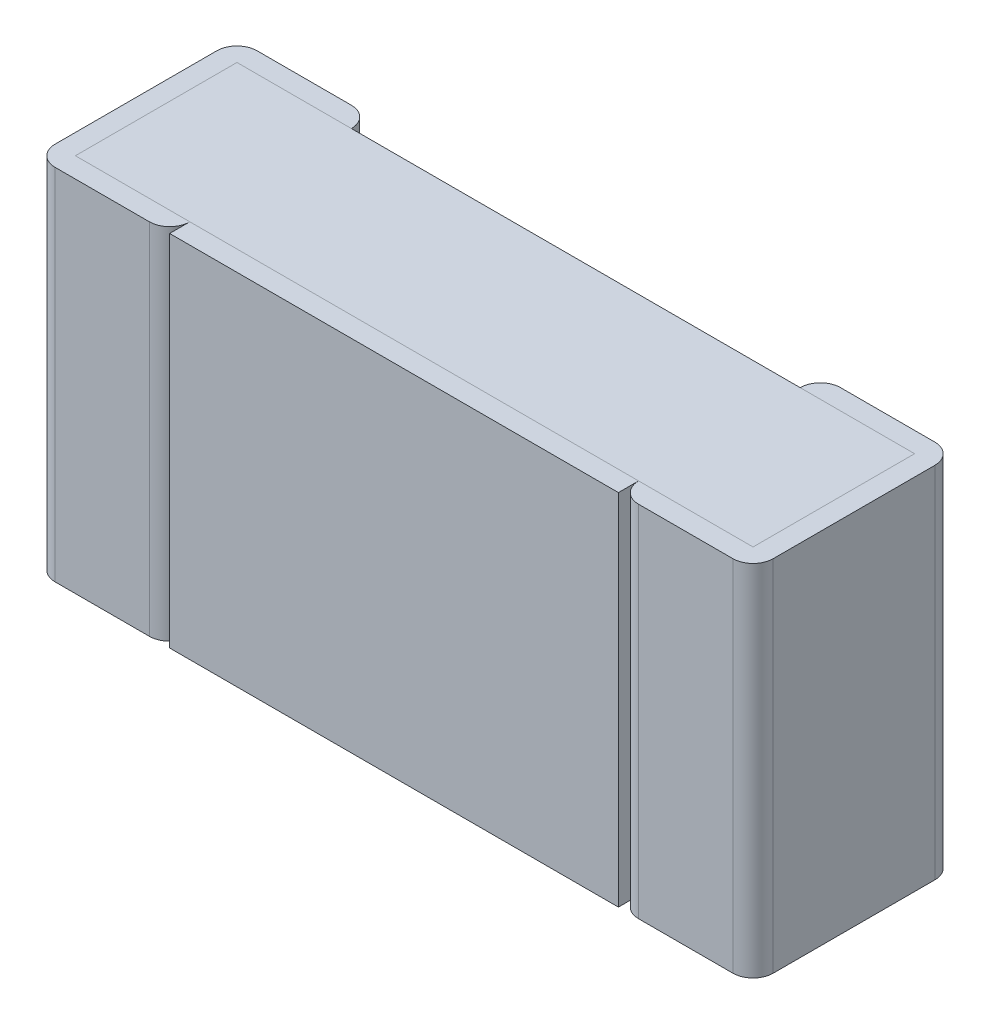
ISO-10303-21;
HEADER;
FILE_DESCRIPTION(('STEP AP214'),'2;1');
FILE_NAME('part.step','',(''),(''),'','','');
FILE_SCHEMA(('AUTOMOTIVE_DESIGN { 1 0 10303 214 1 1 1 1 }'));
ENDSEC;
DATA;
#1=APPLICATION_CONTEXT('core data for automotive mechanical design processes');
#2=APPLICATION_PROTOCOL_DEFINITION('international standard','automotive_design',2000,#1);
#3=PRODUCT_CONTEXT('',#1,'mechanical');
#4=PRODUCT('Part','Part','',(#3));
#5=PRODUCT_RELATED_PRODUCT_CATEGORY('part','',(#4));
#6=PRODUCT_DEFINITION_FORMATION('','',#4);
#7=PRODUCT_DEFINITION_CONTEXT('part definition',#1,'design');
#8=PRODUCT_DEFINITION('design','',#6,#7);
#9=PRODUCT_DEFINITION_SHAPE('','',#8);
#10=(LENGTH_UNIT() NAMED_UNIT(*) SI_UNIT(.MILLI.,.METRE.));
#11=(NAMED_UNIT(*) PLANE_ANGLE_UNIT() SI_UNIT($,.RADIAN.));
#12=(NAMED_UNIT(*) SI_UNIT($,.STERADIAN.) SOLID_ANGLE_UNIT());
#13=UNCERTAINTY_MEASURE_WITH_UNIT(LENGTH_MEASURE(1.E-05),#10,'distance_accuracy_value','');
#14=(GEOMETRIC_REPRESENTATION_CONTEXT(3) GLOBAL_UNCERTAINTY_ASSIGNED_CONTEXT((#13)) GLOBAL_UNIT_ASSIGNED_CONTEXT((#10,
#11,#12)) REPRESENTATION_CONTEXT('',''));
#15=CARTESIAN_POINT('',(0.,0.,0.));
#16=DIRECTION('',(0.,0.,1.));
#17=DIRECTION('',(1.,0.,0.));
#18=AXIS2_PLACEMENT_3D('',#15,#16,#17);
#19=CARTESIAN_POINT('',(181.718744279938,115.36204329235,112.661582908599));
#20=DIRECTION('',(0.,0.,1.));
#21=DIRECTION('',(1.,0.,0.));
#22=AXIS2_PLACEMENT_3D('',#19,#20,#21);
#23=PLANE('',#22);
#24=DIRECTION('',(0.,1.,0.));
#25=VECTOR('',#24,1.);
#26=CARTESIAN_POINT('',(181.718744279938,115.36204329235,112.661582908599));
#27=LINE('',#26,#25);
#28=CARTESIAN_POINT('',(181.718744279938,115.36204329235,112.661582908599));
#29=VERTEX_POINT('',#28);
#30=CARTESIAN_POINT('',(181.718744279938,116.16204329235,112.661582908599));
#31=VERTEX_POINT('',#30);
#32=EDGE_CURVE('E67',#29,#31,#27,.T.);
#33=ORIENTED_EDGE('',*,*,#32,.F.);
#34=DIRECTION('',(1.,0.,0.));
#35=VECTOR('',#34,1.);
#36=CARTESIAN_POINT('',(181.718744279938,115.36204329235,112.661582908599));
#37=LINE('',#36,#35);
#38=CARTESIAN_POINT('',(182.718744279938,115.36204329235,112.661582908599));
#39=VERTEX_POINT('',#38);
#40=EDGE_CURVE('E11',#29,#39,#37,.T.);
#41=ORIENTED_EDGE('',*,*,#40,.T.);
#42=DIRECTION('',(0.,1.,0.));
#43=VECTOR('',#42,1.);
#44=CARTESIAN_POINT('',(182.718744279938,115.36204329235,112.661582908599));
#45=LINE('',#44,#43);
#46=CARTESIAN_POINT('',(182.718744279938,116.16204329235,112.661582908599));
#47=VERTEX_POINT('',#46);
#48=EDGE_CURVE('E55',#39,#47,#45,.T.);
#49=ORIENTED_EDGE('',*,*,#48,.T.);
#50=DIRECTION('',(1.,0.,0.));
#51=VECTOR('',#50,1.);
#52=CARTESIAN_POINT('',(181.718744279938,116.16204329235,112.661582908599));
#53=LINE('',#52,#51);
#54=EDGE_CURVE('E317',#31,#47,#53,.T.);
#55=ORIENTED_EDGE('',*,*,#54,.F.);
#56=EDGE_LOOP('',(#33,#41,#49,#55));
#57=FACE_BOUND('',#56,.T.);
#58=ADVANCED_FACE('F44',(#57),#23,.T.);
#59=CARTESIAN_POINT('',(182.718744279938,115.36204329235,112.616582908599));
#60=DIRECTION('',(1.,0.,0.));
#61=DIRECTION('',(0.,1.,0.));
#62=AXIS2_PLACEMENT_3D('',#59,#60,#61);
#63=PLANE('',#62);
#64=DIRECTION('',(0.,0.,1.));
#65=VECTOR('',#64,1.);
#66=CARTESIAN_POINT('',(182.718744279938,115.36204329235,112.616582908599));
#67=LINE('',#66,#65);
#68=CARTESIAN_POINT('',(182.718744279938,115.36204329235,112.616582908599));
#69=VERTEX_POINT('',#68);
#70=EDGE_CURVE('E341',#69,#39,#67,.T.);
#71=ORIENTED_EDGE('',*,*,#70,.F.);
#72=DIRECTION('',(0.,1.,0.));
#73=VECTOR('',#72,1.);
#74=CARTESIAN_POINT('',(182.718744279938,115.36204329235,112.616582908599));
#75=LINE('',#74,#73);
#76=CARTESIAN_POINT('',(182.718744279938,116.16204329235,112.616582908599));
#77=VERTEX_POINT('',#76);
#78=EDGE_CURVE('E349',#69,#77,#75,.T.);
#79=ORIENTED_EDGE('',*,*,#78,.T.);
#80=DIRECTION('',(0.,0.,1.));
#81=VECTOR('',#80,1.);
#82=CARTESIAN_POINT('',(182.718744279938,116.16204329235,112.616582908599));
#83=LINE('',#82,#81);
#84=EDGE_CURVE('E334',#77,#47,#83,.T.);
#85=ORIENTED_EDGE('',*,*,#84,.T.);
#86=ORIENTED_EDGE('',*,*,#48,.F.);
#87=EDGE_LOOP('',(#71,#79,#85,#86));
#88=FACE_BOUND('',#87,.T.);
#89=ADVANCED_FACE('F417',(#88),#63,.T.);
#90=CARTESIAN_POINT('',(182.763744279938,115.36204329235,112.616582908599));
#91=DIRECTION('',(0.,1.,0.));
#92=DIRECTION('',(-1.,0.,0.));
#93=AXIS2_PLACEMENT_3D('',#90,#91,#92);
#94=CYLINDRICAL_SURFACE('',#93,0.0449999999999895);
#95=CARTESIAN_POINT('',(182.763744279938,115.36204329235,112.616582908599));
#96=DIRECTION('',(0.,1.,0.));
#97=DIRECTION('',(0.,0.,1.));
#98=AXIS2_PLACEMENT_3D('',#95,#96,#97);
#99=CIRCLE('',#98,0.0450000000000034);
#100=CARTESIAN_POINT('',(182.763744279938,115.36204329235,112.661582908599));
#101=VERTEX_POINT('',#100);
#102=EDGE_CURVE('E330',#69,#101,#99,.T.);
#103=ORIENTED_EDGE('',*,*,#102,.T.);
#104=DIRECTION('',(0.,1.,0.));
#105=VECTOR('',#104,1.);
#106=CARTESIAN_POINT('',(182.763744279938,115.36204329235,112.661582908599));
#107=LINE('',#106,#105);
#108=CARTESIAN_POINT('',(182.763744279938,116.16204329235,112.661582908599));
#109=VERTEX_POINT('',#108);
#110=EDGE_CURVE('E335',#101,#109,#107,.T.);
#111=ORIENTED_EDGE('',*,*,#110,.T.);
#112=CARTESIAN_POINT('',(182.763744279938,116.16204329235,112.616582908599));
#113=DIRECTION('',(0.,1.,0.));
#114=DIRECTION('',(0.,0.,1.));
#115=AXIS2_PLACEMENT_3D('',#112,#113,#114);
#116=CIRCLE('',#115,0.0450000000000034);
#117=EDGE_CURVE('E260',#77,#109,#116,.T.);
#118=ORIENTED_EDGE('',*,*,#117,.F.);
#119=ORIENTED_EDGE('',*,*,#78,.F.);
#120=EDGE_LOOP('',(#103,#111,#118,#119));
#121=FACE_BOUND('',#120,.T.);
#122=ADVANCED_FACE('F564',(#121),#94,.T.);
#123=CARTESIAN_POINT('',(182.718744279938,115.36204329235,112.661582908599));
#124=DIRECTION('',(0.,0.,1.));
#125=DIRECTION('',(1.,0.,0.));
#126=AXIS2_PLACEMENT_3D('',#123,#124,#125);
#127=PLANE('',#126);
#128=DIRECTION('',(1.,0.,0.));
#129=VECTOR('',#128,1.);
#130=CARTESIAN_POINT('',(182.718744279938,116.16204329235,112.661582908599));
#131=LINE('',#130,#129);
#132=CARTESIAN_POINT('',(182.973744279938,116.16204329235,112.661582908599));
#133=VERTEX_POINT('',#132);
#134=EDGE_CURVE('E409',#109,#133,#131,.T.);
#135=ORIENTED_EDGE('',*,*,#134,.F.);
#136=ORIENTED_EDGE('',*,*,#110,.F.);
#137=DIRECTION('',(1.,0.,0.));
#138=VECTOR('',#137,1.);
#139=CARTESIAN_POINT('',(182.718744279938,115.36204329235,112.661582908599));
#140=LINE('',#139,#138);
#141=CARTESIAN_POINT('',(182.973744279938,115.36204329235,112.661582908599));
#142=VERTEX_POINT('',#141);
#143=EDGE_CURVE('E401',#101,#142,#140,.T.);
#144=ORIENTED_EDGE('',*,*,#143,.T.);
#145=DIRECTION('',(0.,1.,0.));
#146=VECTOR('',#145,1.);
#147=CARTESIAN_POINT('',(182.973744279938,115.36204329235,112.661582908599));
#148=LINE('',#147,#146);
#149=EDGE_CURVE('E344',#142,#133,#148,.T.);
#150=ORIENTED_EDGE('',*,*,#149,.T.);
#151=EDGE_LOOP('',(#135,#136,#144,#150));
#152=FACE_BOUND('',#151,.T.);
#153=ADVANCED_FACE('F592',(#152),#127,.T.);
#154=CARTESIAN_POINT('',(182.973744279938,115.36204329235,112.616582908599));
#155=DIRECTION('',(0.,1.,0.));
#156=DIRECTION('',(1.,0.,0.));
#157=AXIS2_PLACEMENT_3D('',#154,#155,#156);
#158=CYLINDRICAL_SURFACE('',#157,0.0449999999999895);
#159=DIRECTION('',(0.,1.,0.));
#160=VECTOR('',#159,1.);
#161=CARTESIAN_POINT('',(183.018744279938,115.36204329235,112.616582908599));
#162=LINE('',#161,#160);
#163=CARTESIAN_POINT('',(183.018744279938,115.36204329235,112.616582908599));
#164=VERTEX_POINT('',#163);
#165=CARTESIAN_POINT('',(183.018744279938,116.16204329235,112.616582908599));
#166=VERTEX_POINT('',#165);
#167=EDGE_CURVE('E214',#164,#166,#162,.T.);
#168=ORIENTED_EDGE('',*,*,#167,.T.);
#169=CARTESIAN_POINT('',(182.973744279938,116.16204329235,112.616582908599));
#170=DIRECTION('',(0.,-1.,0.));
#171=DIRECTION('',(0.,0.,1.));
#172=AXIS2_PLACEMENT_3D('',#169,#170,#171);
#173=CIRCLE('',#172,0.0450000000000034);
#174=EDGE_CURVE('E231',#166,#133,#173,.T.);
#175=ORIENTED_EDGE('',*,*,#174,.T.);
#176=ORIENTED_EDGE('',*,*,#149,.F.);
#177=CARTESIAN_POINT('',(182.973744279938,115.36204329235,112.616582908599));
#178=DIRECTION('',(0.,-1.,0.));
#179=DIRECTION('',(0.,0.,1.));
#180=AXIS2_PLACEMENT_3D('',#177,#178,#179);
#181=CIRCLE('',#180,0.0450000000000034);
#182=EDGE_CURVE('E220',#164,#142,#181,.T.);
#183=ORIENTED_EDGE('',*,*,#182,.F.);
#184=EDGE_LOOP('',(#168,#175,#176,#183));
#185=FACE_BOUND('',#184,.T.);
#186=ADVANCED_FACE('F596',(#185),#158,.T.);
#187=CARTESIAN_POINT('',(183.018744279938,115.36204329235,112.211582908599));
#188=DIRECTION('',(1.,0.,0.));
#189=DIRECTION('',(0.,1.,0.));
#190=AXIS2_PLACEMENT_3D('',#187,#188,#189);
#191=PLANE('',#190);
#192=DIRECTION('',(0.,0.,1.));
#193=VECTOR('',#192,1.);
#194=CARTESIAN_POINT('',(183.018744279938,115.36204329235,112.211582908599));
#195=LINE('',#194,#193);
#196=CARTESIAN_POINT('',(183.018744279938,115.36204329235,112.256582908599));
#197=VERTEX_POINT('',#196);
#198=EDGE_CURVE('E207',#197,#164,#195,.T.);
#199=ORIENTED_EDGE('',*,*,#198,.F.);
#200=DIRECTION('',(0.,1.,0.));
#201=VECTOR('',#200,1.);
#202=CARTESIAN_POINT('',(183.018744279938,115.36204329235,112.256582908599));
#203=LINE('',#202,#201);
#204=CARTESIAN_POINT('',(183.018744279938,116.16204329235,112.256582908599));
#205=VERTEX_POINT('',#204);
#206=EDGE_CURVE('E211',#197,#205,#203,.T.);
#207=ORIENTED_EDGE('',*,*,#206,.T.);
#208=DIRECTION('',(0.,0.,1.));
#209=VECTOR('',#208,1.);
#210=CARTESIAN_POINT('',(183.018744279938,116.16204329235,112.211582908599));
#211=LINE('',#210,#209);
#212=EDGE_CURVE('E232',#205,#166,#211,.T.);
#213=ORIENTED_EDGE('',*,*,#212,.T.);
#214=ORIENTED_EDGE('',*,*,#167,.F.);
#215=EDGE_LOOP('',(#199,#207,#213,#214));
#216=FACE_BOUND('',#215,.T.);
#217=ADVANCED_FACE('F209',(#216),#191,.T.);
#218=CARTESIAN_POINT('',(182.973744279938,115.36204329235,112.256582908599));
#219=DIRECTION('',(0.,1.,0.));
#220=DIRECTION('',(1.,0.,0.));
#221=AXIS2_PLACEMENT_3D('',#218,#219,#220);
#222=CYLINDRICAL_SURFACE('',#221,0.0449999999999895);
#223=CARTESIAN_POINT('',(182.973744279938,115.36204329235,112.256582908599));
#224=DIRECTION('',(0.,1.,0.));
#225=DIRECTION('',(0.,0.,1.));
#226=AXIS2_PLACEMENT_3D('',#223,#224,#225);
#227=CIRCLE('',#226,0.0450000000000034);
#228=CARTESIAN_POINT('',(182.973744279938,115.36204329235,112.211582908599));
#229=VERTEX_POINT('',#228);
#230=EDGE_CURVE('E226',#197,#229,#227,.T.);
#231=ORIENTED_EDGE('',*,*,#230,.T.);
#232=DIRECTION('',(0.,1.,0.));
#233=VECTOR('',#232,1.);
#234=CARTESIAN_POINT('',(182.973744279938,115.36204329235,112.211582908599));
#235=LINE('',#234,#233);
#236=CARTESIAN_POINT('',(182.973744279938,116.16204329235,112.211582908599));
#237=VERTEX_POINT('',#236);
#238=EDGE_CURVE('E238',#229,#237,#235,.T.);
#239=ORIENTED_EDGE('',*,*,#238,.T.);
#240=CARTESIAN_POINT('',(182.973744279938,116.16204329235,112.256582908599));
#241=DIRECTION('',(0.,1.,0.));
#242=DIRECTION('',(0.,0.,1.));
#243=AXIS2_PLACEMENT_3D('',#240,#241,#242);
#244=CIRCLE('',#243,0.0450000000000034);
#245=EDGE_CURVE('E229',#205,#237,#244,.T.);
#246=ORIENTED_EDGE('',*,*,#245,.F.);
#247=ORIENTED_EDGE('',*,*,#206,.F.);
#248=EDGE_LOOP('',(#231,#239,#246,#247));
#249=FACE_BOUND('',#248,.T.);
#250=ADVANCED_FACE('F224',(#249),#222,.T.);
#251=CARTESIAN_POINT('',(182.718744279938,115.36204329235,112.211582908599));
#252=DIRECTION('',(0.,0.,1.));
#253=DIRECTION('',(1.,0.,0.));
#254=AXIS2_PLACEMENT_3D('',#251,#252,#253);
#255=PLANE('',#254);
#256=ORIENTED_EDGE('',*,*,#238,.F.);
#257=DIRECTION('',(1.,0.,0.));
#258=VECTOR('',#257,1.);
#259=CARTESIAN_POINT('',(182.718744279938,115.36204329235,112.211582908599));
#260=LINE('',#259,#258);
#261=CARTESIAN_POINT('',(182.763744279938,115.36204329235,112.211582908599));
#262=VERTEX_POINT('',#261);
#263=EDGE_CURVE('E236',#262,#229,#260,.T.);
#264=ORIENTED_EDGE('',*,*,#263,.F.);
#265=DIRECTION('',(0.,1.,0.));
#266=VECTOR('',#265,1.);
#267=CARTESIAN_POINT('',(182.763744279938,115.36204329235,112.211582908599));
#268=LINE('',#267,#266);
#269=CARTESIAN_POINT('',(182.763744279938,116.16204329235,112.211582908599));
#270=VERTEX_POINT('',#269);
#271=EDGE_CURVE('E246',#262,#270,#268,.T.);
#272=ORIENTED_EDGE('',*,*,#271,.T.);
#273=DIRECTION('',(1.,0.,0.));
#274=VECTOR('',#273,1.);
#275=CARTESIAN_POINT('',(182.718744279938,116.16204329235,112.211582908599));
#276=LINE('',#275,#274);
#277=EDGE_CURVE('E286',#270,#237,#276,.T.);
#278=ORIENTED_EDGE('',*,*,#277,.T.);
#279=EDGE_LOOP('',(#256,#264,#272,#278));
#280=FACE_BOUND('',#279,.T.);
#281=ADVANCED_FACE('F473',(#280),#255,.F.);
#282=CARTESIAN_POINT('',(182.763744279938,115.36204329235,112.256582908599));
#283=DIRECTION('',(0.,1.,0.));
#284=DIRECTION('',(-1.,0.,0.));
#285=AXIS2_PLACEMENT_3D('',#282,#283,#284);
#286=CYLINDRICAL_SURFACE('',#285,0.0449999999999895);
#287=DIRECTION('',(0.,1.,0.));
#288=VECTOR('',#287,1.);
#289=CARTESIAN_POINT('',(182.718744279938,115.36204329235,112.256582908599));
#290=LINE('',#289,#288);
#291=CARTESIAN_POINT('',(182.718744279938,115.36204329235,112.256582908599));
#292=VERTEX_POINT('',#291);
#293=CARTESIAN_POINT('',(182.718744279938,116.16204329235,112.256582908599));
#294=VERTEX_POINT('',#293);
#295=EDGE_CURVE('E290',#292,#294,#290,.T.);
#296=ORIENTED_EDGE('',*,*,#295,.T.);
#297=CARTESIAN_POINT('',(182.763744279938,116.16204329235,112.256582908599));
#298=DIRECTION('',(0.,-1.,0.));
#299=DIRECTION('',(0.,0.,1.));
#300=AXIS2_PLACEMENT_3D('',#297,#298,#299);
#301=CIRCLE('',#300,0.0450000000000034);
#302=EDGE_CURVE('E358',#294,#270,#301,.T.);
#303=ORIENTED_EDGE('',*,*,#302,.T.);
#304=ORIENTED_EDGE('',*,*,#271,.F.);
#305=CARTESIAN_POINT('',(182.763744279938,115.36204329235,112.256582908599));
#306=DIRECTION('',(0.,-1.,0.));
#307=DIRECTION('',(0.,0.,1.));
#308=AXIS2_PLACEMENT_3D('',#305,#306,#307);
#309=CIRCLE('',#308,0.0450000000000034);
#310=EDGE_CURVE('E302',#292,#262,#309,.T.);
#311=ORIENTED_EDGE('',*,*,#310,.F.);
#312=EDGE_LOOP('',(#296,#303,#304,#311));
#313=FACE_BOUND('',#312,.T.);
#314=ADVANCED_FACE('F477',(#313),#286,.T.);
#315=CARTESIAN_POINT('',(181.718744279938,116.16204329235,112.616582908599));
#316=DIRECTION('',(0.,1.,0.));
#317=DIRECTION('',(1.,0.,0.));
#318=AXIS2_PLACEMENT_3D('',#315,#316,#317);
#319=PLANE('',#318);
#320=DIRECTION('',(1.,0.,0.));
#321=VECTOR('',#320,1.);
#322=CARTESIAN_POINT('',(181.718744279938,116.16204329235,112.616582908599));
#323=LINE('',#322,#321);
#324=CARTESIAN_POINT('',(181.718744279938,116.16204329235,112.616582908599));
#325=VERTEX_POINT('',#324);
#326=EDGE_CURVE('E291',#325,#77,#323,.T.);
#327=ORIENTED_EDGE('',*,*,#326,.F.);
#328=DIRECTION('',(0.,0.,1.));
#329=VECTOR('',#328,1.);
#330=CARTESIAN_POINT('',(181.718744279938,116.16204329235,112.616582908599));
#331=LINE('',#330,#329);
#332=EDGE_CURVE('E321',#325,#31,#331,.T.);
#333=ORIENTED_EDGE('',*,*,#332,.T.);
#334=ORIENTED_EDGE('',*,*,#54,.T.);
#335=ORIENTED_EDGE('',*,*,#84,.F.);
#336=EDGE_LOOP('',(#327,#333,#334,#335));
#337=FACE_BOUND('',#336,.T.);
#338=ADVANCED_FACE('F549',(#337),#319,.T.);
#339=CARTESIAN_POINT('',(182.718744279938,116.16204329235,112.211582908599));
#340=DIRECTION('',(0.,1.,0.));
#341=DIRECTION('',(1.,0.,0.));
#342=AXIS2_PLACEMENT_3D('',#339,#340,#341);
#343=PLANE('',#342);
#344=ORIENTED_EDGE('',*,*,#277,.F.);
#345=ORIENTED_EDGE('',*,*,#302,.F.);
#346=DIRECTION('',(1.,0.,0.));
#347=VECTOR('',#346,1.);
#348=CARTESIAN_POINT('',(181.463744279938,116.16204329235,112.256582908599));
#349=LINE('',#348,#347);
#350=CARTESIAN_POINT('',(182.973744279938,116.16204329235,112.256582908599));
#351=VERTEX_POINT('',#350);
#352=EDGE_CURVE('E259',#294,#351,#349,.T.);
#353=ORIENTED_EDGE('',*,*,#352,.T.);
#354=DIRECTION('',(0.,0.,1.));
#355=VECTOR('',#354,1.);
#356=CARTESIAN_POINT('',(182.973744279938,116.16204329235,112.256582908599));
#357=LINE('',#356,#355);
#358=CARTESIAN_POINT('',(182.973744279938,116.16204329235,112.616582908599));
#359=VERTEX_POINT('',#358);
#360=EDGE_CURVE('E256',#351,#359,#357,.T.);
#361=ORIENTED_EDGE('',*,*,#360,.T.);
#362=DIRECTION('',(1.,0.,0.));
#363=VECTOR('',#362,1.);
#364=CARTESIAN_POINT('',(181.463744279938,116.16204329235,112.616582908599));
#365=LINE('',#364,#363);
#366=EDGE_CURVE('E295',#77,#359,#365,.T.);
#367=ORIENTED_EDGE('',*,*,#366,.F.);
#368=ORIENTED_EDGE('',*,*,#117,.T.);
#369=ORIENTED_EDGE('',*,*,#134,.T.);
#370=ORIENTED_EDGE('',*,*,#174,.F.);
#371=ORIENTED_EDGE('',*,*,#212,.F.);
#372=ORIENTED_EDGE('',*,*,#245,.T.);
#373=EDGE_LOOP('',(#344,#345,#353,#361,#367,#368,#369,#370,#371,#372));
#374=FACE_BOUND('',#373,.T.);
#375=ADVANCED_FACE('F481',(#374),#343,.T.);
#376=CARTESIAN_POINT('',(181.718744279938,115.36204329235,112.616582908599));
#377=DIRECTION('',(1.,0.,0.));
#378=DIRECTION('',(0.,1.,0.));
#379=AXIS2_PLACEMENT_3D('',#376,#377,#378);
#380=PLANE('',#379);
#381=ORIENTED_EDGE('',*,*,#32,.T.);
#382=ORIENTED_EDGE('',*,*,#332,.F.);
#383=DIRECTION('',(0.,1.,0.));
#384=VECTOR('',#383,1.);
#385=CARTESIAN_POINT('',(181.718744279938,115.36204329235,112.616582908599));
#386=LINE('',#385,#384);
#387=CARTESIAN_POINT('',(181.718744279938,115.36204329235,112.616582908599));
#388=VERTEX_POINT('',#387);
#389=EDGE_CURVE('E325',#388,#325,#386,.T.);
#390=ORIENTED_EDGE('',*,*,#389,.F.);
#391=DIRECTION('',(0.,0.,1.));
#392=VECTOR('',#391,1.);
#393=CARTESIAN_POINT('',(181.718744279938,115.36204329235,112.616582908599));
#394=LINE('',#393,#392);
#395=EDGE_CURVE('E313',#388,#29,#394,.T.);
#396=ORIENTED_EDGE('',*,*,#395,.T.);
#397=EDGE_LOOP('',(#381,#382,#390,#396));
#398=FACE_BOUND('',#397,.T.);
#399=ADVANCED_FACE('F543',(#398),#380,.F.);
#400=CARTESIAN_POINT('',(181.718744279938,115.36204329235,112.616582908599));
#401=DIRECTION('',(0.,1.,0.));
#402=DIRECTION('',(1.,0.,0.));
#403=AXIS2_PLACEMENT_3D('',#400,#401,#402);
#404=PLANE('',#403);
#405=ORIENTED_EDGE('',*,*,#70,.T.);
#406=ORIENTED_EDGE('',*,*,#40,.F.);
#407=ORIENTED_EDGE('',*,*,#395,.F.);
#408=DIRECTION('',(1.,0.,0.));
#409=VECTOR('',#408,1.);
#410=CARTESIAN_POINT('',(181.718744279938,115.36204329235,112.616582908599));
#411=LINE('',#410,#409);
#412=EDGE_CURVE('E219',#388,#69,#411,.T.);
#413=ORIENTED_EDGE('',*,*,#412,.T.);
#414=EDGE_LOOP('',(#405,#406,#407,#413));
#415=FACE_BOUND('',#414,.T.);
#416=ADVANCED_FACE('F587',(#415),#404,.F.);
#417=CARTESIAN_POINT('',(182.718744279938,115.36204329235,112.211582908599));
#418=DIRECTION('',(0.,1.,0.));
#419=DIRECTION('',(1.,0.,0.));
#420=AXIS2_PLACEMENT_3D('',#417,#418,#419);
#421=PLANE('',#420);
#422=ORIENTED_EDGE('',*,*,#230,.F.);
#423=ORIENTED_EDGE('',*,*,#198,.T.);
#424=ORIENTED_EDGE('',*,*,#182,.T.);
#425=ORIENTED_EDGE('',*,*,#143,.F.);
#426=ORIENTED_EDGE('',*,*,#102,.F.);
#427=DIRECTION('',(1.,0.,0.));
#428=VECTOR('',#427,1.);
#429=CARTESIAN_POINT('',(181.463744279938,115.36204329235,112.616582908599));
#430=LINE('',#429,#428);
#431=CARTESIAN_POINT('',(182.973744279938,115.36204329235,112.616582908599));
#432=VERTEX_POINT('',#431);
#433=EDGE_CURVE('E305',#69,#432,#430,.T.);
#434=ORIENTED_EDGE('',*,*,#433,.T.);
#435=DIRECTION('',(0.,0.,1.));
#436=VECTOR('',#435,1.);
#437=CARTESIAN_POINT('',(182.973744279938,115.36204329235,112.256582908599));
#438=LINE('',#437,#436);
#439=CARTESIAN_POINT('',(182.973744279938,115.36204329235,112.256582908599));
#440=VERTEX_POINT('',#439);
#441=EDGE_CURVE('E255',#440,#432,#438,.T.);
#442=ORIENTED_EDGE('',*,*,#441,.F.);
#443=DIRECTION('',(1.,0.,0.));
#444=VECTOR('',#443,1.);
#445=CARTESIAN_POINT('',(181.463744279938,115.36204329235,112.256582908599));
#446=LINE('',#445,#444);
#447=EDGE_CURVE('E251',#292,#440,#446,.T.);
#448=ORIENTED_EDGE('',*,*,#447,.F.);
#449=ORIENTED_EDGE('',*,*,#310,.T.);
#450=ORIENTED_EDGE('',*,*,#263,.T.);
#451=EDGE_LOOP('',(#422,#423,#424,#425,#426,#434,#442,#448,#449,#450));
#452=FACE_BOUND('',#451,.T.);
#453=ADVANCED_FACE('F234',(#452),#421,.F.);
#454=CARTESIAN_POINT('',(181.463744279938,115.36204329235,112.256582908599));
#455=DIRECTION('',(0.,0.,1.));
#456=DIRECTION('',(1.,0.,0.));
#457=AXIS2_PLACEMENT_3D('',#454,#455,#456);
#458=PLANE('',#457);
#459=DIRECTION('',(1.,0.,0.));
#460=VECTOR('',#459,1.);
#461=CARTESIAN_POINT('',(181.463744279938,116.16204329235,112.256582908599));
#462=LINE('',#461,#460);
#463=CARTESIAN_POINT('',(181.718744279938,116.16204329235,112.256582908599));
#464=VERTEX_POINT('',#463);
#465=EDGE_CURVE('E338',#464,#294,#462,.T.);
#466=ORIENTED_EDGE('',*,*,#465,.T.);
#467=ORIENTED_EDGE('',*,*,#295,.F.);
#468=DIRECTION('',(1.,0.,0.));
#469=VECTOR('',#468,1.);
#470=CARTESIAN_POINT('',(181.463744279938,115.36204329235,112.256582908599));
#471=LINE('',#470,#469);
#472=CARTESIAN_POINT('',(181.718744279938,115.36204329235,112.256582908599));
#473=VERTEX_POINT('',#472);
#474=EDGE_CURVE('E254',#473,#292,#471,.T.);
#475=ORIENTED_EDGE('',*,*,#474,.F.);
#476=DIRECTION('',(0.,1.,0.));
#477=VECTOR('',#476,1.);
#478=CARTESIAN_POINT('',(181.718744279938,115.36204329235,112.256582908599));
#479=LINE('',#478,#477);
#480=EDGE_CURVE('E359',#473,#464,#479,.T.);
#481=ORIENTED_EDGE('',*,*,#480,.T.);
#482=EDGE_LOOP('',(#466,#467,#475,#481));
#483=FACE_BOUND('',#482,.T.);
#484=ADVANCED_FACE('F527',(#483),#458,.F.);
#485=CARTESIAN_POINT('',(181.463744279938,116.16204329235,112.256582908599));
#486=DIRECTION('',(0.,1.,0.));
#487=DIRECTION('',(1.,0.,0.));
#488=AXIS2_PLACEMENT_3D('',#485,#486,#487);
#489=PLANE('',#488);
#490=DIRECTION('',(1.,0.,0.));
#491=VECTOR('',#490,1.);
#492=CARTESIAN_POINT('',(181.463744279938,116.16204329235,112.256582908599));
#493=LINE('',#492,#491);
#494=CARTESIAN_POINT('',(181.463744279938,116.16204329235,112.256582908599));
#495=VERTEX_POINT('',#494);
#496=EDGE_CURVE('E284',#495,#464,#493,.T.);
#497=ORIENTED_EDGE('',*,*,#496,.F.);
#498=DIRECTION('',(0.,0.,1.));
#499=VECTOR('',#498,1.);
#500=CARTESIAN_POINT('',(181.463744279938,116.16204329235,112.256582908599));
#501=LINE('',#500,#499);
#502=CARTESIAN_POINT('',(181.463744279938,116.16204329235,112.616582908599));
#503=VERTEX_POINT('',#502);
#504=EDGE_CURVE('E362',#495,#503,#501,.T.);
#505=ORIENTED_EDGE('',*,*,#504,.T.);
#506=DIRECTION('',(1.,0.,0.));
#507=VECTOR('',#506,1.);
#508=CARTESIAN_POINT('',(181.463744279938,116.16204329235,112.616582908599));
#509=LINE('',#508,#507);
#510=EDGE_CURVE('E294',#503,#325,#509,.T.);
#511=ORIENTED_EDGE('',*,*,#510,.T.);
#512=ORIENTED_EDGE('',*,*,#326,.T.);
#513=ORIENTED_EDGE('',*,*,#366,.T.);
#514=ORIENTED_EDGE('',*,*,#360,.F.);
#515=ORIENTED_EDGE('',*,*,#352,.F.);
#516=ORIENTED_EDGE('',*,*,#465,.F.);
#517=EDGE_LOOP('',(#497,#505,#511,#512,#513,#514,#515,#516));
#518=FACE_BOUND('',#517,.T.);
#519=ADVANCED_FACE('F532',(#518),#489,.T.);
#520=CARTESIAN_POINT('',(181.673744279938,115.36204329235,112.616582908599));
#521=DIRECTION('',(0.,1.,0.));
#522=DIRECTION('',(1.,0.,0.));
#523=AXIS2_PLACEMENT_3D('',#520,#521,#522);
#524=CYLINDRICAL_SURFACE('',#523,0.0449999999999895);
#525=ORIENTED_EDGE('',*,*,#389,.T.);
#526=CARTESIAN_POINT('',(181.673744279938,116.16204329235,112.616582908599));
#527=DIRECTION('',(0.,-1.,0.));
#528=DIRECTION('',(0.,0.,1.));
#529=AXIS2_PLACEMENT_3D('',#526,#527,#528);
#530=CIRCLE('',#529,0.0450000000000034);
#531=CARTESIAN_POINT('',(181.673744279938,116.16204329235,112.661582908599));
#532=VERTEX_POINT('',#531);
#533=EDGE_CURVE('E265',#325,#532,#530,.T.);
#534=ORIENTED_EDGE('',*,*,#533,.T.);
#535=DIRECTION('',(0.,1.,0.));
#536=VECTOR('',#535,1.);
#537=CARTESIAN_POINT('',(181.673744279938,115.36204329235,112.661582908599));
#538=LINE('',#537,#536);
#539=CARTESIAN_POINT('',(181.673744279938,115.36204329235,112.661582908599));
#540=VERTEX_POINT('',#539);
#541=EDGE_CURVE('E266',#540,#532,#538,.T.);
#542=ORIENTED_EDGE('',*,*,#541,.F.);
#543=CARTESIAN_POINT('',(181.673744279938,115.36204329235,112.616582908599));
#544=DIRECTION('',(0.,-1.,0.));
#545=DIRECTION('',(0.,0.,1.));
#546=AXIS2_PLACEMENT_3D('',#543,#544,#545);
#547=CIRCLE('',#546,0.0450000000000034);
#548=EDGE_CURVE('E279',#388,#540,#547,.T.);
#549=ORIENTED_EDGE('',*,*,#548,.F.);
#550=EDGE_LOOP('',(#525,#534,#542,#549));
#551=FACE_BOUND('',#550,.T.);
#552=ADVANCED_FACE('F548',(#551),#524,.T.);
#553=CARTESIAN_POINT('',(181.418744279938,115.36204329235,112.661582908599));
#554=DIRECTION('',(0.,0.,1.));
#555=DIRECTION('',(1.,0.,0.));
#556=AXIS2_PLACEMENT_3D('',#553,#554,#555);
#557=PLANE('',#556);
#558=DIRECTION('',(1.,0.,0.));
#559=VECTOR('',#558,1.);
#560=CARTESIAN_POINT('',(181.418744279938,116.16204329235,112.661582908599));
#561=LINE('',#560,#559);
#562=CARTESIAN_POINT('',(181.463744279938,116.16204329235,112.661582908599));
#563=VERTEX_POINT('',#562);
#564=EDGE_CURVE('E316',#563,#532,#561,.T.);
#565=ORIENTED_EDGE('',*,*,#564,.F.);
#566=DIRECTION('',(0.,1.,0.));
#567=VECTOR('',#566,1.);
#568=CARTESIAN_POINT('',(181.463744279938,115.36204329235,112.661582908599));
#569=LINE('',#568,#567);
#570=CARTESIAN_POINT('',(181.463744279938,115.36204329235,112.661582908599));
#571=VERTEX_POINT('',#570);
#572=EDGE_CURVE('E383',#571,#563,#569,.T.);
#573=ORIENTED_EDGE('',*,*,#572,.F.);
#574=DIRECTION('',(1.,0.,0.));
#575=VECTOR('',#574,1.);
#576=CARTESIAN_POINT('',(181.418744279938,115.36204329235,112.661582908599));
#577=LINE('',#576,#575);
#578=EDGE_CURVE('E261',#571,#540,#577,.T.);
#579=ORIENTED_EDGE('',*,*,#578,.T.);
#580=ORIENTED_EDGE('',*,*,#541,.T.);
#581=EDGE_LOOP('',(#565,#573,#579,#580));
#582=FACE_BOUND('',#581,.T.);
#583=ADVANCED_FACE('F569',(#582),#557,.T.);
#584=CARTESIAN_POINT('',(181.463744279938,115.36204329235,112.256582908599));
#585=DIRECTION('',(0.,1.,0.));
#586=DIRECTION('',(1.,0.,0.));
#587=AXIS2_PLACEMENT_3D('',#584,#585,#586);
#588=PLANE('',#587);
#589=ORIENTED_EDGE('',*,*,#474,.T.);
#590=ORIENTED_EDGE('',*,*,#447,.T.);
#591=ORIENTED_EDGE('',*,*,#441,.T.);
#592=ORIENTED_EDGE('',*,*,#433,.F.);
#593=ORIENTED_EDGE('',*,*,#412,.F.);
#594=DIRECTION('',(1.,0.,0.));
#595=VECTOR('',#594,1.);
#596=CARTESIAN_POINT('',(181.463744279938,115.36204329235,112.616582908599));
#597=LINE('',#596,#595);
#598=CARTESIAN_POINT('',(181.463744279938,115.36204329235,112.616582908599));
#599=VERTEX_POINT('',#598);
#600=EDGE_CURVE('E460',#599,#388,#597,.T.);
#601=ORIENTED_EDGE('',*,*,#600,.F.);
#602=DIRECTION('',(0.,0.,1.));
#603=VECTOR('',#602,1.);
#604=CARTESIAN_POINT('',(181.463744279938,115.36204329235,112.256582908599));
#605=LINE('',#604,#603);
#606=CARTESIAN_POINT('',(181.463744279938,115.36204329235,112.256582908599));
#607=VERTEX_POINT('',#606);
#608=EDGE_CURVE('E301',#607,#599,#605,.T.);
#609=ORIENTED_EDGE('',*,*,#608,.F.);
#610=DIRECTION('',(1.,0.,0.));
#611=VECTOR('',#610,1.);
#612=CARTESIAN_POINT('',(181.463744279938,115.36204329235,112.256582908599));
#613=LINE('',#612,#611);
#614=EDGE_CURVE('E48',#607,#473,#613,.T.);
#615=ORIENTED_EDGE('',*,*,#614,.T.);
#616=EDGE_LOOP('',(#589,#590,#591,#592,#593,#601,#609,#615));
#617=FACE_BOUND('',#616,.T.);
#618=ADVANCED_FACE('F572',(#617),#588,.F.);
#619=CARTESIAN_POINT('',(181.673744279938,115.36204329235,112.256582908599));
#620=DIRECTION('',(0.,1.,0.));
#621=DIRECTION('',(1.,0.,0.));
#622=AXIS2_PLACEMENT_3D('',#619,#620,#621);
#623=CYLINDRICAL_SURFACE('',#622,0.0449999999999895);
#624=CARTESIAN_POINT('',(181.673744279938,115.36204329235,112.256582908599));
#625=DIRECTION('',(0.,1.,0.));
#626=DIRECTION('',(0.,0.,1.));
#627=AXIS2_PLACEMENT_3D('',#624,#625,#626);
#628=CIRCLE('',#627,0.0450000000000034);
#629=CARTESIAN_POINT('',(181.673744279938,115.36204329235,112.211582908599));
#630=VERTEX_POINT('',#629);
#631=EDGE_CURVE('E271',#473,#630,#628,.T.);
#632=ORIENTED_EDGE('',*,*,#631,.T.);
#633=DIRECTION('',(0.,1.,0.));
#634=VECTOR('',#633,1.);
#635=CARTESIAN_POINT('',(181.673744279938,115.36204329235,112.211582908599));
#636=LINE('',#635,#634);
#637=CARTESIAN_POINT('',(181.673744279938,116.16204329235,112.211582908599));
#638=VERTEX_POINT('',#637);
#639=EDGE_CURVE('E267',#630,#638,#636,.T.);
#640=ORIENTED_EDGE('',*,*,#639,.T.);
#641=CARTESIAN_POINT('',(181.673744279938,116.16204329235,112.256582908599));
#642=DIRECTION('',(0.,1.,0.));
#643=DIRECTION('',(0.,0.,1.));
#644=AXIS2_PLACEMENT_3D('',#641,#642,#643);
#645=CIRCLE('',#644,0.0450000000000034);
#646=EDGE_CURVE('E281',#464,#638,#645,.T.);
#647=ORIENTED_EDGE('',*,*,#646,.F.);
#648=ORIENTED_EDGE('',*,*,#480,.F.);
#649=EDGE_LOOP('',(#632,#640,#647,#648));
#650=FACE_BOUND('',#649,.T.);
#651=ADVANCED_FACE('F535',(#650),#623,.T.);
#652=CARTESIAN_POINT('',(181.418744279938,115.36204329235,112.211582908599));
#653=DIRECTION('',(0.,0.,1.));
#654=DIRECTION('',(1.,0.,0.));
#655=AXIS2_PLACEMENT_3D('',#652,#653,#654);
#656=PLANE('',#655);
#657=ORIENTED_EDGE('',*,*,#639,.F.);
#658=DIRECTION('',(1.,0.,0.));
#659=VECTOR('',#658,1.);
#660=CARTESIAN_POINT('',(181.418744279938,115.36204329235,112.211582908599));
#661=LINE('',#660,#659);
#662=CARTESIAN_POINT('',(181.463744279938,115.36204329235,112.211582908599));
#663=VERTEX_POINT('',#662);
#664=EDGE_CURVE('E280',#663,#630,#661,.T.);
#665=ORIENTED_EDGE('',*,*,#664,.F.);
#666=DIRECTION('',(0.,1.,0.));
#667=VECTOR('',#666,1.);
#668=CARTESIAN_POINT('',(181.463744279938,115.36204329235,112.211582908599));
#669=LINE('',#668,#667);
#670=CARTESIAN_POINT('',(181.463744279938,116.16204329235,112.211582908599));
#671=VERTEX_POINT('',#670);
#672=EDGE_CURVE('E272',#663,#671,#669,.T.);
#673=ORIENTED_EDGE('',*,*,#672,.T.);
#674=DIRECTION('',(1.,0.,0.));
#675=VECTOR('',#674,1.);
#676=CARTESIAN_POINT('',(181.418744279938,116.16204329235,112.211582908599));
#677=LINE('',#676,#675);
#678=EDGE_CURVE('E306',#671,#638,#677,.T.);
#679=ORIENTED_EDGE('',*,*,#678,.T.);
#680=EDGE_LOOP('',(#657,#665,#673,#679));
#681=FACE_BOUND('',#680,.T.);
#682=ADVANCED_FACE('F603',(#681),#656,.F.);
#683=CARTESIAN_POINT('',(181.418744279938,116.16204329235,112.211582908599));
#684=DIRECTION('',(0.,1.,0.));
#685=DIRECTION('',(1.,0.,0.));
#686=AXIS2_PLACEMENT_3D('',#683,#684,#685);
#687=PLANE('',#686);
#688=ORIENTED_EDGE('',*,*,#678,.F.);
#689=CARTESIAN_POINT('',(181.463744279938,116.16204329235,112.256582908599));
#690=DIRECTION('',(0.,-1.,0.));
#691=DIRECTION('',(0.,0.,1.));
#692=AXIS2_PLACEMENT_3D('',#689,#690,#691);
#693=CIRCLE('',#692,0.0450000000000034);
#694=CARTESIAN_POINT('',(181.418744279938,116.16204329235,112.256582908599));
#695=VERTEX_POINT('',#694);
#696=EDGE_CURVE('E296',#695,#671,#693,.T.);
#697=ORIENTED_EDGE('',*,*,#696,.F.);
#698=DIRECTION('',(0.,0.,1.));
#699=VECTOR('',#698,1.);
#700=CARTESIAN_POINT('',(181.418744279938,116.16204329235,112.211582908599));
#701=LINE('',#700,#699);
#702=CARTESIAN_POINT('',(181.418744279938,116.16204329235,112.616582908599));
#703=VERTEX_POINT('',#702);
#704=EDGE_CURVE('E310',#695,#703,#701,.T.);
#705=ORIENTED_EDGE('',*,*,#704,.T.);
#706=CARTESIAN_POINT('',(181.463744279938,116.16204329235,112.616582908599));
#707=DIRECTION('',(0.,1.,0.));
#708=DIRECTION('',(0.,0.,1.));
#709=AXIS2_PLACEMENT_3D('',#706,#707,#708);
#710=CIRCLE('',#709,0.0450000000000034);
#711=EDGE_CURVE('E326',#703,#563,#710,.T.);
#712=ORIENTED_EDGE('',*,*,#711,.T.);
#713=ORIENTED_EDGE('',*,*,#564,.T.);
#714=ORIENTED_EDGE('',*,*,#533,.F.);
#715=ORIENTED_EDGE('',*,*,#510,.F.);
#716=ORIENTED_EDGE('',*,*,#504,.F.);
#717=ORIENTED_EDGE('',*,*,#496,.T.);
#718=ORIENTED_EDGE('',*,*,#646,.T.);
#719=EDGE_LOOP('',(#688,#697,#705,#712,#713,#714,#715,#716,#717,#718));
#720=FACE_BOUND('',#719,.T.);
#721=ADVANCED_FACE('F538',(#720),#687,.T.);
#722=CARTESIAN_POINT('',(181.463744279938,115.36204329235,112.616582908599));
#723=DIRECTION('',(0.,1.,0.));
#724=DIRECTION('',(-1.,0.,0.));
#725=AXIS2_PLACEMENT_3D('',#722,#723,#724);
#726=CYLINDRICAL_SURFACE('',#725,0.0449999999999895);
#727=CARTESIAN_POINT('',(181.463744279938,115.36204329235,112.616582908599));
#728=DIRECTION('',(0.,1.,0.));
#729=DIRECTION('',(0.,0.,1.));
#730=AXIS2_PLACEMENT_3D('',#727,#728,#729);
#731=CIRCLE('',#730,0.0450000000000034);
#732=CARTESIAN_POINT('',(181.418744279938,115.36204329235,112.616582908599));
#733=VERTEX_POINT('',#732);
#734=EDGE_CURVE('E285',#733,#571,#731,.T.);
#735=ORIENTED_EDGE('',*,*,#734,.T.);
#736=ORIENTED_EDGE('',*,*,#572,.T.);
#737=ORIENTED_EDGE('',*,*,#711,.F.);
#738=DIRECTION('',(0.,1.,0.));
#739=VECTOR('',#738,1.);
#740=CARTESIAN_POINT('',(181.418744279938,115.36204329235,112.616582908599));
#741=LINE('',#740,#739);
#742=EDGE_CURVE('E348',#733,#703,#741,.T.);
#743=ORIENTED_EDGE('',*,*,#742,.F.);
#744=EDGE_LOOP('',(#735,#736,#737,#743));
#745=FACE_BOUND('',#744,.T.);
#746=ADVANCED_FACE('F579',(#745),#726,.T.);
#747=CARTESIAN_POINT('',(181.463744279938,115.36204329235,112.256582908599));
#748=DIRECTION('',(0.,1.,0.));
#749=DIRECTION('',(-1.,0.,0.));
#750=AXIS2_PLACEMENT_3D('',#747,#748,#749);
#751=CYLINDRICAL_SURFACE('',#750,0.0449999999999895);
#752=DIRECTION('',(0.,1.,0.));
#753=VECTOR('',#752,1.);
#754=CARTESIAN_POINT('',(181.418744279938,115.36204329235,112.256582908599));
#755=LINE('',#754,#753);
#756=CARTESIAN_POINT('',(181.418744279938,115.36204329235,112.256582908599));
#757=VERTEX_POINT('',#756);
#758=EDGE_CURVE('E300',#757,#695,#755,.T.);
#759=ORIENTED_EDGE('',*,*,#758,.T.);
#760=ORIENTED_EDGE('',*,*,#696,.T.);
#761=ORIENTED_EDGE('',*,*,#672,.F.);
#762=CARTESIAN_POINT('',(181.463744279938,115.36204329235,112.256582908599));
#763=DIRECTION('',(0.,-1.,0.));
#764=DIRECTION('',(0.,0.,1.));
#765=AXIS2_PLACEMENT_3D('',#762,#763,#764);
#766=CIRCLE('',#765,0.0450000000000034);
#767=EDGE_CURVE('E275',#757,#663,#766,.T.);
#768=ORIENTED_EDGE('',*,*,#767,.F.);
#769=EDGE_LOOP('',(#759,#760,#761,#768));
#770=FACE_BOUND('',#769,.T.);
#771=ADVANCED_FACE('F576',(#770),#751,.T.);
#772=CARTESIAN_POINT('',(181.418744279938,115.36204329235,112.211582908599));
#773=DIRECTION('',(0.,1.,0.));
#774=DIRECTION('',(1.,0.,0.));
#775=AXIS2_PLACEMENT_3D('',#772,#773,#774);
#776=PLANE('',#775);
#777=ORIENTED_EDGE('',*,*,#631,.F.);
#778=ORIENTED_EDGE('',*,*,#614,.F.);
#779=ORIENTED_EDGE('',*,*,#608,.T.);
#780=ORIENTED_EDGE('',*,*,#600,.T.);
#781=ORIENTED_EDGE('',*,*,#548,.T.);
#782=ORIENTED_EDGE('',*,*,#578,.F.);
#783=ORIENTED_EDGE('',*,*,#734,.F.);
#784=DIRECTION('',(0.,0.,1.));
#785=VECTOR('',#784,1.);
#786=CARTESIAN_POINT('',(181.418744279938,115.36204329235,112.211582908599));
#787=LINE('',#786,#785);
#788=EDGE_CURVE('E446',#757,#733,#787,.T.);
#789=ORIENTED_EDGE('',*,*,#788,.F.);
#790=ORIENTED_EDGE('',*,*,#767,.T.);
#791=ORIENTED_EDGE('',*,*,#664,.T.);
#792=EDGE_LOOP('',(#777,#778,#779,#780,#781,#782,#783,#789,#790,#791));
#793=FACE_BOUND('',#792,.T.);
#794=ADVANCED_FACE('F578',(#793),#776,.F.);
#795=CARTESIAN_POINT('',(181.418744279938,115.36204329235,112.211582908599));
#796=DIRECTION('',(1.,0.,0.));
#797=DIRECTION('',(0.,1.,0.));
#798=AXIS2_PLACEMENT_3D('',#795,#796,#797);
#799=PLANE('',#798);
#800=ORIENTED_EDGE('',*,*,#742,.T.);
#801=ORIENTED_EDGE('',*,*,#704,.F.);
#802=ORIENTED_EDGE('',*,*,#758,.F.);
#803=ORIENTED_EDGE('',*,*,#788,.T.);
#804=EDGE_LOOP('',(#800,#801,#802,#803));
#805=FACE_BOUND('',#804,.T.);
#806=ADVANCED_FACE('F46',(#805),#799,.F.);
#807=CLOSED_SHELL('',(#58,#89,#122,#153,#186,#217,#250,#281,#314,#338,#375,#399,#416,#453,#484,
#519,#552,#583,#618,#651,#682,#721,#746,#771,#794,#806));
#808=MANIFOLD_SOLID_BREP('B2',#807);
#809=ADVANCED_BREP_SHAPE_REPRESENTATION('',(#18,#808),#14);
#810=SHAPE_DEFINITION_REPRESENTATION(#9,#809);
ENDSEC;
END-ISO-10303-21;
